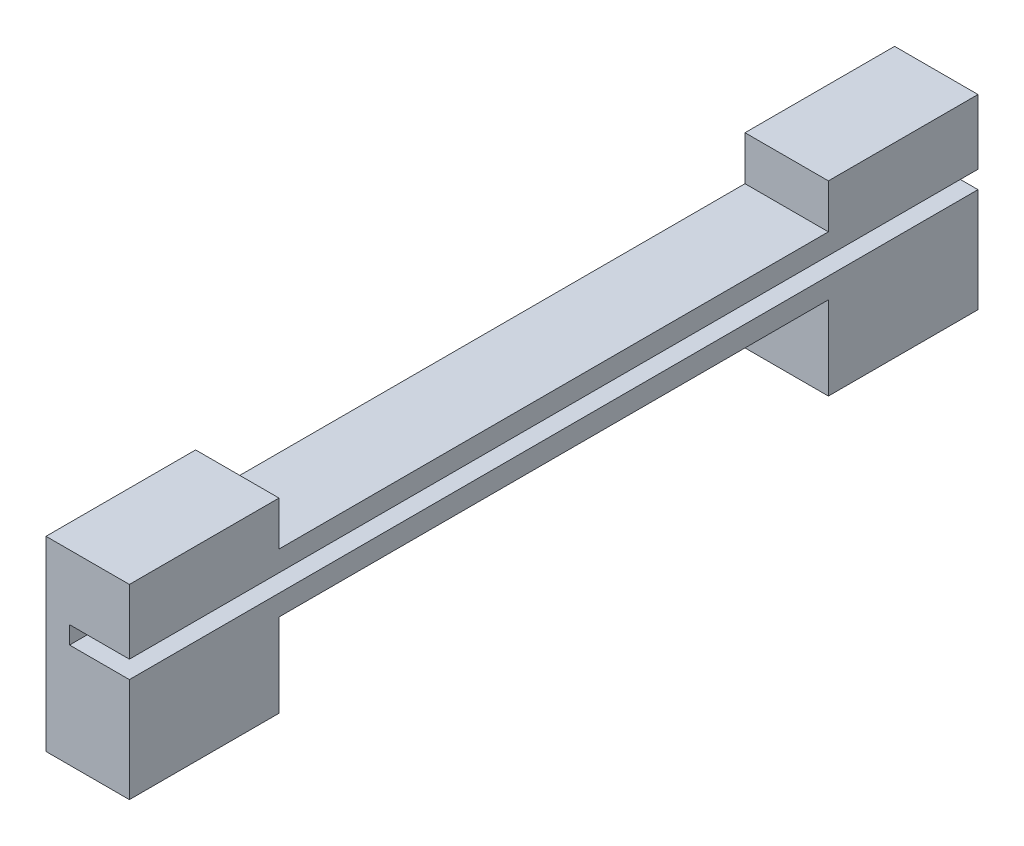
ISO-10303-21;
HEADER;
FILE_DESCRIPTION(('STEP AP214'),'2;1');
FILE_NAME('part.step','',(''),(''),'','','');
FILE_SCHEMA(('AUTOMOTIVE_DESIGN { 1 0 10303 214 1 1 1 1 }'));
ENDSEC;
DATA;
#1=APPLICATION_CONTEXT('core data for automotive mechanical design processes');
#2=APPLICATION_PROTOCOL_DEFINITION('international standard','automotive_design',2000,#1);
#3=PRODUCT_CONTEXT('',#1,'mechanical');
#4=PRODUCT('Part','Part','',(#3));
#5=PRODUCT_RELATED_PRODUCT_CATEGORY('part','',(#4));
#6=PRODUCT_DEFINITION_FORMATION('','',#4);
#7=PRODUCT_DEFINITION_CONTEXT('part definition',#1,'design');
#8=PRODUCT_DEFINITION('design','',#6,#7);
#9=PRODUCT_DEFINITION_SHAPE('','',#8);
#10=(LENGTH_UNIT() NAMED_UNIT(*) SI_UNIT(.MILLI.,.METRE.));
#11=(NAMED_UNIT(*) PLANE_ANGLE_UNIT() SI_UNIT($,.RADIAN.));
#12=(NAMED_UNIT(*) SI_UNIT($,.STERADIAN.) SOLID_ANGLE_UNIT());
#13=UNCERTAINTY_MEASURE_WITH_UNIT(LENGTH_MEASURE(1.E-05),#10,'distance_accuracy_value','');
#14=(GEOMETRIC_REPRESENTATION_CONTEXT(3) GLOBAL_UNCERTAINTY_ASSIGNED_CONTEXT((#13)) GLOBAL_UNIT_ASSIGNED_CONTEXT((#10,
#11,#12)) REPRESENTATION_CONTEXT('',''));
#15=CARTESIAN_POINT('',(0.,0.,0.));
#16=DIRECTION('',(0.,0.,1.));
#17=DIRECTION('',(1.,0.,0.));
#18=AXIS2_PLACEMENT_3D('',#15,#16,#17);
#19=CARTESIAN_POINT('',(8.5,0.,0.));
#20=DIRECTION('',(-1.,0.,0.));
#21=DIRECTION('',(0.,0.,1.));
#22=AXIS2_PLACEMENT_3D('',#19,#20,#21);
#23=PLANE('',#22);
#24=DIRECTION('',(0.,0.,-1.));
#25=VECTOR('',#24,1.);
#26=CARTESIAN_POINT('',(8.5,6.6,0.));
#27=LINE('',#26,#25);
#28=CARTESIAN_POINT('',(8.5,6.6,0.));
#29=VERTEX_POINT('',#28);
#30=CARTESIAN_POINT('',(8.5,6.6,-86.5));
#31=VERTEX_POINT('',#30);
#32=EDGE_CURVE('E289',#29,#31,#27,.T.);
#33=ORIENTED_EDGE('',*,*,#32,.F.);
#34=DIRECTION('',(0.,-1.,0.));
#35=VECTOR('',#34,1.);
#36=CARTESIAN_POINT('',(8.5,15.,0.));
#37=LINE('',#36,#35);
#38=CARTESIAN_POINT('',(8.5,-4.,0.));
#39=VERTEX_POINT('',#38);
#40=EDGE_CURVE('E239',#29,#39,#37,.T.);
#41=ORIENTED_EDGE('',*,*,#40,.T.);
#42=DIRECTION('',(0.,0.,1.));
#43=VECTOR('',#42,1.);
#44=CARTESIAN_POINT('',(8.5,-4.,0.));
#45=LINE('',#44,#43);
#46=CARTESIAN_POINT('',(8.5,-4.,-15.25));
#47=VERTEX_POINT('',#46);
#48=EDGE_CURVE('E256',#47,#39,#45,.T.);
#49=ORIENTED_EDGE('',*,*,#48,.F.);
#50=DIRECTION('',(0.,1.,0.));
#51=VECTOR('',#50,1.);
#52=CARTESIAN_POINT('',(8.5,0.,-15.25));
#53=LINE('',#52,#51);
#54=CARTESIAN_POINT('',(8.5,4.5,-15.25));
#55=VERTEX_POINT('',#54);
#56=EDGE_CURVE('E128',#47,#55,#53,.T.);
#57=ORIENTED_EDGE('',*,*,#56,.T.);
#58=DIRECTION('',(0.,0.,-1.));
#59=VECTOR('',#58,1.);
#60=CARTESIAN_POINT('',(8.5,4.5,-15.25));
#61=LINE('',#60,#59);
#62=CARTESIAN_POINT('',(8.5,4.5,-71.25));
#63=VERTEX_POINT('',#62);
#64=EDGE_CURVE('E118',#55,#63,#61,.T.);
#65=ORIENTED_EDGE('',*,*,#64,.T.);
#66=DIRECTION('',(0.,-1.,0.));
#67=VECTOR('',#66,1.);
#68=CARTESIAN_POINT('',(8.5,4.5,-71.25));
#69=LINE('',#68,#67);
#70=CARTESIAN_POINT('',(8.5,-4.,-71.25));
#71=VERTEX_POINT('',#70);
#72=EDGE_CURVE('E124',#63,#71,#69,.T.);
#73=ORIENTED_EDGE('',*,*,#72,.T.);
#74=DIRECTION('',(0.,0.,1.));
#75=VECTOR('',#74,1.);
#76=CARTESIAN_POINT('',(8.5,-4.,-86.5));
#77=LINE('',#76,#75);
#78=CARTESIAN_POINT('',(8.5,-4.,-86.5));
#79=VERTEX_POINT('',#78);
#80=EDGE_CURVE('E270',#79,#71,#77,.T.);
#81=ORIENTED_EDGE('',*,*,#80,.F.);
#82=DIRECTION('',(0.,1.,0.));
#83=VECTOR('',#82,1.);
#84=CARTESIAN_POINT('',(8.5,0.,-86.5));
#85=LINE('',#84,#83);
#86=EDGE_CURVE('E154',#79,#31,#85,.T.);
#87=ORIENTED_EDGE('',*,*,#86,.T.);
#88=EDGE_LOOP('',(#33,#41,#49,#57,#65,#73,#81,#87));
#89=FACE_BOUND('',#88,.T.);
#90=ADVANCED_FACE('F39',(#89),#23,.F.);
#91=CARTESIAN_POINT('',(8.5,15.,0.));
#92=DIRECTION('',(0.,0.,-1.));
#93=DIRECTION('',(0.,1.,0.));
#94=AXIS2_PLACEMENT_3D('',#91,#92,#93);
#95=PLANE('',#94);
#96=DIRECTION('',(0.,-1.,0.));
#97=VECTOR('',#96,1.);
#98=CARTESIAN_POINT('',(2.4,8.35,0.));
#99=LINE('',#98,#97);
#100=CARTESIAN_POINT('',(2.4,8.4,0.));
#101=VERTEX_POINT('',#100);
#102=CARTESIAN_POINT('',(2.4,6.6,0.));
#103=VERTEX_POINT('',#102);
#104=EDGE_CURVE('E297',#101,#103,#99,.T.);
#105=ORIENTED_EDGE('',*,*,#104,.F.);
#106=DIRECTION('',(-1.,0.,0.));
#107=VECTOR('',#106,1.);
#108=CARTESIAN_POINT('',(8.5,8.4,0.));
#109=LINE('',#108,#107);
#110=CARTESIAN_POINT('',(8.5,8.4,0.));
#111=VERTEX_POINT('',#110);
#112=EDGE_CURVE('E236',#111,#101,#109,.T.);
#113=ORIENTED_EDGE('',*,*,#112,.F.);
#114=CARTESIAN_POINT('',(8.5,15.,0.));
#115=VERTEX_POINT('',#114);
#116=EDGE_CURVE('E233',#115,#111,#37,.T.);
#117=ORIENTED_EDGE('',*,*,#116,.F.);
#118=DIRECTION('',(-1.,0.,0.));
#119=VECTOR('',#118,1.);
#120=CARTESIAN_POINT('',(8.5,15.,0.));
#121=LINE('',#120,#119);
#122=CARTESIAN_POINT('',(0.,15.,0.));
#123=VERTEX_POINT('',#122);
#124=EDGE_CURVE('E200',#115,#123,#121,.T.);
#125=ORIENTED_EDGE('',*,*,#124,.T.);
#126=DIRECTION('',(0.,-1.,0.));
#127=VECTOR('',#126,1.);
#128=CARTESIAN_POINT('',(0.,15.,0.));
#129=LINE('',#128,#127);
#130=CARTESIAN_POINT('',(0.,-4.,0.));
#131=VERTEX_POINT('',#130);
#132=EDGE_CURVE('E177',#123,#131,#129,.T.);
#133=ORIENTED_EDGE('',*,*,#132,.T.);
#134=DIRECTION('',(-1.,0.,0.));
#135=VECTOR('',#134,1.);
#136=CARTESIAN_POINT('',(0.,-4.,0.));
#137=LINE('',#136,#135);
#138=EDGE_CURVE('E168',#39,#131,#137,.T.);
#139=ORIENTED_EDGE('',*,*,#138,.F.);
#140=ORIENTED_EDGE('',*,*,#40,.F.);
#141=DIRECTION('',(1.,0.,0.));
#142=VECTOR('',#141,1.);
#143=CARTESIAN_POINT('',(8.5,6.6,0.));
#144=LINE('',#143,#142);
#145=EDGE_CURVE('E281',#103,#29,#144,.T.);
#146=ORIENTED_EDGE('',*,*,#145,.F.);
#147=EDGE_LOOP('',(#105,#113,#117,#125,#133,#139,#140,#146));
#148=FACE_BOUND('',#147,.T.);
#149=ADVANCED_FACE('F228',(#148),#95,.F.);
#150=CARTESIAN_POINT('',(8.5,0.,-86.5));
#151=DIRECTION('',(0.,0.,1.));
#152=DIRECTION('',(0.,-1.,0.));
#153=AXIS2_PLACEMENT_3D('',#150,#151,#152);
#154=PLANE('',#153);
#155=DIRECTION('',(1.,0.,0.));
#156=VECTOR('',#155,1.);
#157=CARTESIAN_POINT('',(8.5,8.4,-86.5));
#158=LINE('',#157,#156);
#159=CARTESIAN_POINT('',(2.4,8.4,-86.5));
#160=VERTEX_POINT('',#159);
#161=CARTESIAN_POINT('',(8.5,8.4,-86.5));
#162=VERTEX_POINT('',#161);
#163=EDGE_CURVE('E305',#160,#162,#158,.T.);
#164=ORIENTED_EDGE('',*,*,#163,.F.);
#165=DIRECTION('',(0.,1.,0.));
#166=VECTOR('',#165,1.);
#167=CARTESIAN_POINT('',(2.4,8.35,-86.5));
#168=LINE('',#167,#166);
#169=CARTESIAN_POINT('',(2.4,6.6,-86.5));
#170=VERTEX_POINT('',#169);
#171=EDGE_CURVE('E301',#170,#160,#168,.T.);
#172=ORIENTED_EDGE('',*,*,#171,.F.);
#173=DIRECTION('',(-1.,0.,0.));
#174=VECTOR('',#173,1.);
#175=CARTESIAN_POINT('',(8.5,6.6,-86.5));
#176=LINE('',#175,#174);
#177=EDGE_CURVE('E285',#31,#170,#176,.T.);
#178=ORIENTED_EDGE('',*,*,#177,.F.);
#179=ORIENTED_EDGE('',*,*,#86,.F.);
#180=DIRECTION('',(1.,0.,0.));
#181=VECTOR('',#180,1.);
#182=CARTESIAN_POINT('',(0.,-4.,-86.5));
#183=LINE('',#182,#181);
#184=CARTESIAN_POINT('',(0.,-4.,-86.5));
#185=VERTEX_POINT('',#184);
#186=EDGE_CURVE('E273',#185,#79,#183,.T.);
#187=ORIENTED_EDGE('',*,*,#186,.F.);
#188=DIRECTION('',(0.,1.,0.));
#189=VECTOR('',#188,1.);
#190=CARTESIAN_POINT('',(0.,0.,-86.5));
#191=LINE('',#190,#189);
#192=CARTESIAN_POINT('',(0.,15.,-86.5));
#193=VERTEX_POINT('',#192);
#194=EDGE_CURVE('E87',#185,#193,#191,.T.);
#195=ORIENTED_EDGE('',*,*,#194,.T.);
#196=DIRECTION('',(-1.,0.,0.));
#197=VECTOR('',#196,1.);
#198=CARTESIAN_POINT('',(8.5,15.,-86.5));
#199=LINE('',#198,#197);
#200=CARTESIAN_POINT('',(8.5,15.,-86.5));
#201=VERTEX_POINT('',#200);
#202=EDGE_CURVE('E144',#201,#193,#199,.T.);
#203=ORIENTED_EDGE('',*,*,#202,.F.);
#204=EDGE_CURVE('E151',#162,#201,#85,.T.);
#205=ORIENTED_EDGE('',*,*,#204,.F.);
#206=EDGE_LOOP('',(#164,#172,#178,#179,#187,#195,#203,#205));
#207=FACE_BOUND('',#206,.T.);
#208=ADVANCED_FACE('F329',(#207),#154,.F.);
#209=ORIENTED_EDGE('',*,*,#116,.T.);
#210=DIRECTION('',(0.,0.,1.));
#211=VECTOR('',#210,1.);
#212=CARTESIAN_POINT('',(8.5,8.4,0.));
#213=LINE('',#212,#211);
#214=EDGE_CURVE('E315',#162,#111,#213,.T.);
#215=ORIENTED_EDGE('',*,*,#214,.F.);
#216=ORIENTED_EDGE('',*,*,#204,.T.);
#217=DIRECTION('',(0.,0.,1.));
#218=VECTOR('',#217,1.);
#219=CARTESIAN_POINT('',(8.5,15.,-86.5));
#220=LINE('',#219,#218);
#221=CARTESIAN_POINT('',(8.5,15.,-71.25));
#222=VERTEX_POINT('',#221);
#223=EDGE_CURVE('E57',#201,#222,#220,.T.);
#224=ORIENTED_EDGE('',*,*,#223,.T.);
#225=DIRECTION('',(0.,-1.,0.));
#226=VECTOR('',#225,1.);
#227=CARTESIAN_POINT('',(8.5,15.,-71.25));
#228=LINE('',#227,#226);
#229=CARTESIAN_POINT('',(8.5,10.5,-71.25));
#230=VERTEX_POINT('',#229);
#231=EDGE_CURVE('E193',#222,#230,#228,.T.);
#232=ORIENTED_EDGE('',*,*,#231,.T.);
#233=DIRECTION('',(0.,0.,1.));
#234=VECTOR('',#233,1.);
#235=CARTESIAN_POINT('',(8.5,10.5,-71.25));
#236=LINE('',#235,#234);
#237=CARTESIAN_POINT('',(8.5,10.5,-15.25));
#238=VERTEX_POINT('',#237);
#239=EDGE_CURVE('E101',#230,#238,#236,.T.);
#240=ORIENTED_EDGE('',*,*,#239,.T.);
#241=DIRECTION('',(0.,1.,0.));
#242=VECTOR('',#241,1.);
#243=CARTESIAN_POINT('',(8.5,10.5,-15.25));
#244=LINE('',#243,#242);
#245=CARTESIAN_POINT('',(8.5,15.,-15.25));
#246=VERTEX_POINT('',#245);
#247=EDGE_CURVE('E214',#238,#246,#244,.T.);
#248=ORIENTED_EDGE('',*,*,#247,.T.);
#249=DIRECTION('',(0.,0.,1.));
#250=VECTOR('',#249,1.);
#251=CARTESIAN_POINT('',(8.5,15.,-15.25));
#252=LINE('',#251,#250);
#253=EDGE_CURVE('E244',#246,#115,#252,.T.);
#254=ORIENTED_EDGE('',*,*,#253,.T.);
#255=EDGE_LOOP('',(#209,#215,#216,#224,#232,#240,#248,#254));
#256=FACE_BOUND('',#255,.T.);
#257=ADVANCED_FACE('F325',(#256),#23,.F.);
#258=CARTESIAN_POINT('',(8.5,15.,-71.25));
#259=DIRECTION('',(0.,0.,-1.));
#260=DIRECTION('',(-1.,0.,0.));
#261=AXIS2_PLACEMENT_3D('',#258,#259,#260);
#262=PLANE('',#261);
#263=DIRECTION('',(0.,-1.,0.));
#264=VECTOR('',#263,1.);
#265=CARTESIAN_POINT('',(0.,15.,-71.25));
#266=LINE('',#265,#264);
#267=CARTESIAN_POINT('',(0.,15.,-71.25));
#268=VERTEX_POINT('',#267);
#269=CARTESIAN_POINT('',(0.,10.5,-71.25));
#270=VERTEX_POINT('',#269);
#271=EDGE_CURVE('E163',#268,#270,#266,.T.);
#272=ORIENTED_EDGE('',*,*,#271,.T.);
#273=DIRECTION('',(-1.,0.,0.));
#274=VECTOR('',#273,1.);
#275=CARTESIAN_POINT('',(8.5,10.5,-71.25));
#276=LINE('',#275,#274);
#277=EDGE_CURVE('E11',#230,#270,#276,.T.);
#278=ORIENTED_EDGE('',*,*,#277,.F.);
#279=ORIENTED_EDGE('',*,*,#231,.F.);
#280=DIRECTION('',(-1.,0.,0.));
#281=VECTOR('',#280,1.);
#282=CARTESIAN_POINT('',(8.5,15.,-71.25));
#283=LINE('',#282,#281);
#284=EDGE_CURVE('E162',#222,#268,#283,.T.);
#285=ORIENTED_EDGE('',*,*,#284,.T.);
#286=EDGE_LOOP('',(#272,#278,#279,#285));
#287=FACE_BOUND('',#286,.T.);
#288=ADVANCED_FACE('F41',(#287),#262,.F.);
#289=CARTESIAN_POINT('',(8.5,10.5,-71.25));
#290=DIRECTION('',(0.,-1.,0.));
#291=DIRECTION('',(0.,0.,-1.));
#292=AXIS2_PLACEMENT_3D('',#289,#290,#291);
#293=PLANE('',#292);
#294=DIRECTION('',(0.,0.,1.));
#295=VECTOR('',#294,1.);
#296=CARTESIAN_POINT('',(0.,10.5,-71.25));
#297=LINE('',#296,#295);
#298=CARTESIAN_POINT('',(0.,10.5,-15.25));
#299=VERTEX_POINT('',#298);
#300=EDGE_CURVE('E167',#270,#299,#297,.T.);
#301=ORIENTED_EDGE('',*,*,#300,.T.);
#302=DIRECTION('',(-1.,0.,0.));
#303=VECTOR('',#302,1.);
#304=CARTESIAN_POINT('',(8.5,10.5,-15.25));
#305=LINE('',#304,#303);
#306=EDGE_CURVE('E49',#238,#299,#305,.T.);
#307=ORIENTED_EDGE('',*,*,#306,.F.);
#308=ORIENTED_EDGE('',*,*,#239,.F.);
#309=ORIENTED_EDGE('',*,*,#277,.T.);
#310=EDGE_LOOP('',(#301,#307,#308,#309));
#311=FACE_BOUND('',#310,.T.);
#312=ADVANCED_FACE('F335',(#311),#293,.F.);
#313=CARTESIAN_POINT('',(8.5,10.5,-15.25));
#314=DIRECTION('',(0.,0.,1.));
#315=DIRECTION('',(0.,-1.,0.));
#316=AXIS2_PLACEMENT_3D('',#313,#314,#315);
#317=PLANE('',#316);
#318=DIRECTION('',(0.,1.,0.));
#319=VECTOR('',#318,1.);
#320=CARTESIAN_POINT('',(0.,10.5,-15.25));
#321=LINE('',#320,#319);
#322=CARTESIAN_POINT('',(0.,15.,-15.25));
#323=VERTEX_POINT('',#322);
#324=EDGE_CURVE('E171',#299,#323,#321,.T.);
#325=ORIENTED_EDGE('',*,*,#324,.T.);
#326=DIRECTION('',(-1.,0.,0.));
#327=VECTOR('',#326,1.);
#328=CARTESIAN_POINT('',(8.5,15.,-15.25));
#329=LINE('',#328,#327);
#330=EDGE_CURVE('E204',#246,#323,#329,.T.);
#331=ORIENTED_EDGE('',*,*,#330,.F.);
#332=ORIENTED_EDGE('',*,*,#247,.F.);
#333=ORIENTED_EDGE('',*,*,#306,.T.);
#334=EDGE_LOOP('',(#325,#331,#332,#333));
#335=FACE_BOUND('',#334,.T.);
#336=ADVANCED_FACE('F212',(#335),#317,.F.);
#337=CARTESIAN_POINT('',(8.5,15.,-15.25));
#338=DIRECTION('',(0.,-1.,0.));
#339=DIRECTION('',(0.,0.,-1.));
#340=AXIS2_PLACEMENT_3D('',#337,#338,#339);
#341=PLANE('',#340);
#342=DIRECTION('',(0.,0.,1.));
#343=VECTOR('',#342,1.);
#344=CARTESIAN_POINT('',(0.,15.,-15.25));
#345=LINE('',#344,#343);
#346=EDGE_CURVE('E174',#323,#123,#345,.T.);
#347=ORIENTED_EDGE('',*,*,#346,.T.);
#348=ORIENTED_EDGE('',*,*,#124,.F.);
#349=ORIENTED_EDGE('',*,*,#253,.F.);
#350=ORIENTED_EDGE('',*,*,#330,.T.);
#351=EDGE_LOOP('',(#347,#348,#349,#350));
#352=FACE_BOUND('',#351,.T.);
#353=ADVANCED_FACE('F223',(#352),#341,.F.);
#354=CARTESIAN_POINT('',(8.5,0.,-15.25));
#355=DIRECTION('',(0.,0.,1.));
#356=DIRECTION('',(1.,0.,0.));
#357=AXIS2_PLACEMENT_3D('',#354,#355,#356);
#358=PLANE('',#357);
#359=DIRECTION('',(0.,1.,0.));
#360=VECTOR('',#359,1.);
#361=CARTESIAN_POINT('',(0.,0.,-15.25));
#362=LINE('',#361,#360);
#363=CARTESIAN_POINT('',(0.,-4.,-15.25));
#364=VERTEX_POINT('',#363);
#365=CARTESIAN_POINT('',(0.,4.5,-15.25));
#366=VERTEX_POINT('',#365);
#367=EDGE_CURVE('E181',#364,#366,#362,.T.);
#368=ORIENTED_EDGE('',*,*,#367,.T.);
#369=DIRECTION('',(-1.,0.,0.));
#370=VECTOR('',#369,1.);
#371=CARTESIAN_POINT('',(8.5,4.5,-15.25));
#372=LINE('',#371,#370);
#373=EDGE_CURVE('E143',#55,#366,#372,.T.);
#374=ORIENTED_EDGE('',*,*,#373,.F.);
#375=ORIENTED_EDGE('',*,*,#56,.F.);
#376=DIRECTION('',(1.,0.,0.));
#377=VECTOR('',#376,1.);
#378=CARTESIAN_POINT('',(0.,-4.,-15.25));
#379=LINE('',#378,#377);
#380=EDGE_CURVE('E260',#364,#47,#379,.T.);
#381=ORIENTED_EDGE('',*,*,#380,.F.);
#382=EDGE_LOOP('',(#368,#374,#375,#381));
#383=FACE_BOUND('',#382,.T.);
#384=ADVANCED_FACE('F363',(#383),#358,.F.);
#385=CARTESIAN_POINT('',(8.5,4.5,-15.25));
#386=DIRECTION('',(0.,1.,0.));
#387=DIRECTION('',(0.,0.,1.));
#388=AXIS2_PLACEMENT_3D('',#385,#386,#387);
#389=PLANE('',#388);
#390=DIRECTION('',(0.,0.,-1.));
#391=VECTOR('',#390,1.);
#392=CARTESIAN_POINT('',(0.,4.5,-15.25));
#393=LINE('',#392,#391);
#394=CARTESIAN_POINT('',(0.,4.5,-71.25));
#395=VERTEX_POINT('',#394);
#396=EDGE_CURVE('E138',#366,#395,#393,.T.);
#397=ORIENTED_EDGE('',*,*,#396,.T.);
#398=DIRECTION('',(-1.,0.,0.));
#399=VECTOR('',#398,1.);
#400=CARTESIAN_POINT('',(8.5,4.5,-71.25));
#401=LINE('',#400,#399);
#402=EDGE_CURVE('E135',#63,#395,#401,.T.);
#403=ORIENTED_EDGE('',*,*,#402,.F.);
#404=ORIENTED_EDGE('',*,*,#64,.F.);
#405=ORIENTED_EDGE('',*,*,#373,.T.);
#406=EDGE_LOOP('',(#397,#403,#404,#405));
#407=FACE_BOUND('',#406,.T.);
#408=ADVANCED_FACE('F136',(#407),#389,.F.);
#409=CARTESIAN_POINT('',(8.5,4.5,-71.25));
#410=DIRECTION('',(0.,0.,-1.));
#411=DIRECTION('',(-1.,0.,0.));
#412=AXIS2_PLACEMENT_3D('',#409,#410,#411);
#413=PLANE('',#412);
#414=DIRECTION('',(0.,-1.,0.));
#415=VECTOR('',#414,1.);
#416=CARTESIAN_POINT('',(0.,4.5,-71.25));
#417=LINE('',#416,#415);
#418=CARTESIAN_POINT('',(0.,-4.,-71.25));
#419=VERTEX_POINT('',#418);
#420=EDGE_CURVE('E186',#395,#419,#417,.T.);
#421=ORIENTED_EDGE('',*,*,#420,.T.);
#422=DIRECTION('',(-1.,0.,0.));
#423=VECTOR('',#422,1.);
#424=CARTESIAN_POINT('',(0.,-4.,-71.25));
#425=LINE('',#424,#423);
#426=EDGE_CURVE('E149',#71,#419,#425,.T.);
#427=ORIENTED_EDGE('',*,*,#426,.F.);
#428=ORIENTED_EDGE('',*,*,#72,.F.);
#429=ORIENTED_EDGE('',*,*,#402,.T.);
#430=EDGE_LOOP('',(#421,#427,#428,#429));
#431=FACE_BOUND('',#430,.T.);
#432=ADVANCED_FACE('F147',(#431),#413,.F.);
#433=CARTESIAN_POINT('',(8.5,15.,-86.5));
#434=DIRECTION('',(0.,-1.,0.));
#435=DIRECTION('',(0.,0.,-1.));
#436=AXIS2_PLACEMENT_3D('',#433,#434,#435);
#437=PLANE('',#436);
#438=DIRECTION('',(0.,0.,1.));
#439=VECTOR('',#438,1.);
#440=CARTESIAN_POINT('',(0.,15.,-86.5));
#441=LINE('',#440,#439);
#442=EDGE_CURVE('E93',#193,#268,#441,.T.);
#443=ORIENTED_EDGE('',*,*,#442,.T.);
#444=ORIENTED_EDGE('',*,*,#284,.F.);
#445=ORIENTED_EDGE('',*,*,#223,.F.);
#446=ORIENTED_EDGE('',*,*,#202,.T.);
#447=EDGE_LOOP('',(#443,#444,#445,#446));
#448=FACE_BOUND('',#447,.T.);
#449=ADVANCED_FACE('F331',(#448),#437,.F.);
#450=CARTESIAN_POINT('',(0.,0.,0.));
#451=DIRECTION('',(-1.,0.,0.));
#452=DIRECTION('',(0.,0.,1.));
#453=AXIS2_PLACEMENT_3D('',#450,#451,#452);
#454=PLANE('',#453);
#455=ORIENTED_EDGE('',*,*,#271,.F.);
#456=ORIENTED_EDGE('',*,*,#442,.F.);
#457=ORIENTED_EDGE('',*,*,#194,.F.);
#458=DIRECTION('',(0.,0.,-1.));
#459=VECTOR('',#458,1.);
#460=CARTESIAN_POINT('',(0.,-4.,-86.5));
#461=LINE('',#460,#459);
#462=EDGE_CURVE('E277',#419,#185,#461,.T.);
#463=ORIENTED_EDGE('',*,*,#462,.F.);
#464=ORIENTED_EDGE('',*,*,#420,.F.);
#465=ORIENTED_EDGE('',*,*,#396,.F.);
#466=ORIENTED_EDGE('',*,*,#367,.F.);
#467=DIRECTION('',(0.,0.,-1.));
#468=VECTOR('',#467,1.);
#469=CARTESIAN_POINT('',(0.,-4.,0.));
#470=LINE('',#469,#468);
#471=EDGE_CURVE('E264',#131,#364,#470,.T.);
#472=ORIENTED_EDGE('',*,*,#471,.F.);
#473=ORIENTED_EDGE('',*,*,#132,.F.);
#474=ORIENTED_EDGE('',*,*,#346,.F.);
#475=ORIENTED_EDGE('',*,*,#324,.F.);
#476=ORIENTED_EDGE('',*,*,#300,.F.);
#477=EDGE_LOOP('',(#455,#456,#457,#463,#464,#465,#466,#472,#473,#474,#475,#476));
#478=FACE_BOUND('',#477,.T.);
#479=ADVANCED_FACE('F218',(#478),#454,.T.);
#480=CARTESIAN_POINT('',(0.,-4.,0.));
#481=DIRECTION('',(0.,-1.,0.));
#482=DIRECTION('',(0.,0.,-1.));
#483=AXIS2_PLACEMENT_3D('',#480,#481,#482);
#484=PLANE('',#483);
#485=ORIENTED_EDGE('',*,*,#471,.T.);
#486=ORIENTED_EDGE('',*,*,#380,.T.);
#487=ORIENTED_EDGE('',*,*,#48,.T.);
#488=ORIENTED_EDGE('',*,*,#138,.T.);
#489=EDGE_LOOP('',(#485,#486,#487,#488));
#490=FACE_BOUND('',#489,.T.);
#491=ADVANCED_FACE('F396',(#490),#484,.T.);
#492=CARTESIAN_POINT('',(0.,-4.,0.));
#493=DIRECTION('',(0.,1.,0.));
#494=DIRECTION('',(0.,0.,1.));
#495=AXIS2_PLACEMENT_3D('',#492,#493,#494);
#496=PLANE('',#495);
#497=ORIENTED_EDGE('',*,*,#462,.T.);
#498=ORIENTED_EDGE('',*,*,#186,.T.);
#499=ORIENTED_EDGE('',*,*,#80,.T.);
#500=ORIENTED_EDGE('',*,*,#426,.T.);
#501=EDGE_LOOP('',(#497,#498,#499,#500));
#502=FACE_BOUND('',#501,.T.);
#503=ADVANCED_FACE('F402',(#502),#496,.F.);
#504=CARTESIAN_POINT('',(0.,6.6,0.));
#505=DIRECTION('',(0.,1.,0.));
#506=DIRECTION('',(0.,0.,1.));
#507=AXIS2_PLACEMENT_3D('',#504,#505,#506);
#508=PLANE('',#507);
#509=ORIENTED_EDGE('',*,*,#32,.T.);
#510=ORIENTED_EDGE('',*,*,#177,.T.);
#511=DIRECTION('',(0.,0.,-1.));
#512=VECTOR('',#511,1.);
#513=CARTESIAN_POINT('',(2.4,6.6,-86.5));
#514=LINE('',#513,#512);
#515=EDGE_CURVE('E293',#103,#170,#514,.T.);
#516=ORIENTED_EDGE('',*,*,#515,.F.);
#517=ORIENTED_EDGE('',*,*,#145,.T.);
#518=EDGE_LOOP('',(#509,#510,#516,#517));
#519=FACE_BOUND('',#518,.T.);
#520=ADVANCED_FACE('F408',(#519),#508,.T.);
#521=CARTESIAN_POINT('',(2.4,0.,0.));
#522=DIRECTION('',(-1.,0.,0.));
#523=DIRECTION('',(0.,0.,1.));
#524=AXIS2_PLACEMENT_3D('',#521,#522,#523);
#525=PLANE('',#524);
#526=ORIENTED_EDGE('',*,*,#171,.T.);
#527=DIRECTION('',(0.,0.,-1.));
#528=VECTOR('',#527,1.);
#529=CARTESIAN_POINT('',(2.4,8.4,0.));
#530=LINE('',#529,#528);
#531=EDGE_CURVE('E309',#101,#160,#530,.T.);
#532=ORIENTED_EDGE('',*,*,#531,.F.);
#533=ORIENTED_EDGE('',*,*,#104,.T.);
#534=ORIENTED_EDGE('',*,*,#515,.T.);
#535=EDGE_LOOP('',(#526,#532,#533,#534));
#536=FACE_BOUND('',#535,.T.);
#537=ADVANCED_FACE('F416',(#536),#525,.F.);
#538=CARTESIAN_POINT('',(0.,8.4,0.));
#539=DIRECTION('',(0.,1.,0.));
#540=DIRECTION('',(0.,0.,1.));
#541=AXIS2_PLACEMENT_3D('',#538,#539,#540);
#542=PLANE('',#541);
#543=ORIENTED_EDGE('',*,*,#214,.T.);
#544=ORIENTED_EDGE('',*,*,#112,.T.);
#545=ORIENTED_EDGE('',*,*,#531,.T.);
#546=ORIENTED_EDGE('',*,*,#163,.T.);
#547=EDGE_LOOP('',(#543,#544,#545,#546));
#548=FACE_BOUND('',#547,.T.);
#549=ADVANCED_FACE('F319',(#548),#542,.F.);
#550=CLOSED_SHELL('',(#90,#149,#208,#257,#288,#312,#336,#353,#384,#408,#432,#449,#479,#491,#503,
#520,#537,#549));
#551=MANIFOLD_SOLID_BREP('B2',#550);
#552=ADVANCED_BREP_SHAPE_REPRESENTATION('',(#18,#551),#14);
#553=SHAPE_DEFINITION_REPRESENTATION(#9,#552);
ENDSEC;
END-ISO-10303-21;
